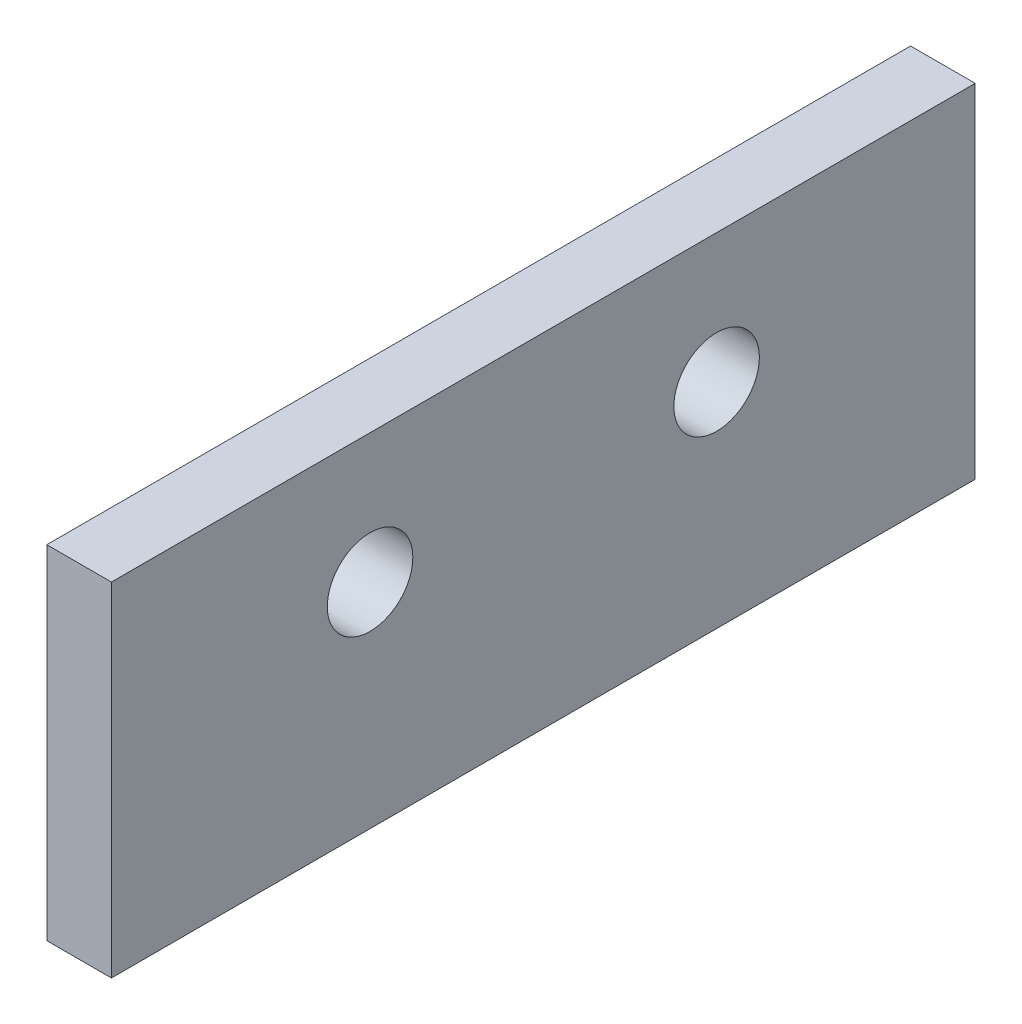
ISO-10303-21;
HEADER;
FILE_DESCRIPTION(('STEP AP214'),'2;1');
FILE_NAME('part.step','',(''),(''),'','','');
FILE_SCHEMA(('AUTOMOTIVE_DESIGN { 1 0 10303 214 1 1 1 1 }'));
ENDSEC;
DATA;
#1=APPLICATION_CONTEXT('core data for automotive mechanical design processes');
#2=APPLICATION_PROTOCOL_DEFINITION('international standard','automotive_design',2000,#1);
#3=PRODUCT_CONTEXT('',#1,'mechanical');
#4=PRODUCT('Part','Part','',(#3));
#5=PRODUCT_RELATED_PRODUCT_CATEGORY('part','',(#4));
#6=PRODUCT_DEFINITION_FORMATION('','',#4);
#7=PRODUCT_DEFINITION_CONTEXT('part definition',#1,'design');
#8=PRODUCT_DEFINITION('design','',#6,#7);
#9=PRODUCT_DEFINITION_SHAPE('','',#8);
#10=(LENGTH_UNIT() NAMED_UNIT(*) SI_UNIT(.MILLI.,.METRE.));
#11=(NAMED_UNIT(*) PLANE_ANGLE_UNIT() SI_UNIT($,.RADIAN.));
#12=(NAMED_UNIT(*) SI_UNIT($,.STERADIAN.) SOLID_ANGLE_UNIT());
#13=UNCERTAINTY_MEASURE_WITH_UNIT(LENGTH_MEASURE(1.E-05),#10,'distance_accuracy_value','');
#14=(GEOMETRIC_REPRESENTATION_CONTEXT(3) GLOBAL_UNCERTAINTY_ASSIGNED_CONTEXT((#13)) GLOBAL_UNIT_ASSIGNED_CONTEXT((#10,
#11,#12)) REPRESENTATION_CONTEXT('',''));
#15=CARTESIAN_POINT('',(0.,0.,0.));
#16=DIRECTION('',(0.,0.,1.));
#17=DIRECTION('',(1.,0.,0.));
#18=AXIS2_PLACEMENT_3D('',#15,#16,#17);
#19=CARTESIAN_POINT('',(3.175,-8.4201,-21.209));
#20=DIRECTION('',(0.,0.,1.));
#21=DIRECTION('',(1.,0.,0.));
#22=AXIS2_PLACEMENT_3D('',#19,#20,#21);
#23=PLANE('',#22);
#24=DIRECTION('',(0.,1.,0.));
#25=VECTOR('',#24,1.);
#26=CARTESIAN_POINT('',(0.,-8.4201,-21.209));
#27=LINE('',#26,#25);
#28=CARTESIAN_POINT('',(0.,-8.4201,-21.209));
#29=VERTEX_POINT('',#28);
#30=CARTESIAN_POINT('',(0.,8.4201,-21.209));
#31=VERTEX_POINT('',#30);
#32=EDGE_CURVE('E101',#29,#31,#27,.T.);
#33=ORIENTED_EDGE('',*,*,#32,.T.);
#34=DIRECTION('',(-1.,0.,0.));
#35=VECTOR('',#34,1.);
#36=CARTESIAN_POINT('',(3.175,8.4201,-21.209));
#37=LINE('',#36,#35);
#38=CARTESIAN_POINT('',(3.175,8.4201,-21.209));
#39=VERTEX_POINT('',#38);
#40=EDGE_CURVE('E11',#39,#31,#37,.T.);
#41=ORIENTED_EDGE('',*,*,#40,.F.);
#42=DIRECTION('',(0.,1.,0.));
#43=VECTOR('',#42,1.);
#44=CARTESIAN_POINT('',(3.175,-8.4201,-21.209));
#45=LINE('',#44,#43);
#46=CARTESIAN_POINT('',(3.175,-8.4201,-21.209));
#47=VERTEX_POINT('',#46);
#48=EDGE_CURVE('E89',#47,#39,#45,.T.);
#49=ORIENTED_EDGE('',*,*,#48,.F.);
#50=DIRECTION('',(-1.,0.,0.));
#51=VECTOR('',#50,1.);
#52=CARTESIAN_POINT('',(3.175,-8.4201,-21.209));
#53=LINE('',#52,#51);
#54=EDGE_CURVE('E97',#47,#29,#53,.T.);
#55=ORIENTED_EDGE('',*,*,#54,.T.);
#56=EDGE_LOOP('',(#33,#41,#49,#55));
#57=FACE_BOUND('',#56,.T.);
#58=ADVANCED_FACE('F38',(#57),#23,.F.);
#59=CARTESIAN_POINT('',(3.175,8.4201,21.209));
#60=DIRECTION('',(0.,-1.,0.));
#61=DIRECTION('',(0.,0.,-1.));
#62=AXIS2_PLACEMENT_3D('',#59,#60,#61);
#63=PLANE('',#62);
#64=DIRECTION('',(0.,0.,1.));
#65=VECTOR('',#64,1.);
#66=CARTESIAN_POINT('',(0.,8.4201,21.209));
#67=LINE('',#66,#65);
#68=CARTESIAN_POINT('',(0.,8.4201,21.209));
#69=VERTEX_POINT('',#68);
#70=EDGE_CURVE('E93',#31,#69,#67,.T.);
#71=ORIENTED_EDGE('',*,*,#70,.T.);
#72=DIRECTION('',(-1.,0.,0.));
#73=VECTOR('',#72,1.);
#74=CARTESIAN_POINT('',(3.175,8.4201,21.209));
#75=LINE('',#74,#73);
#76=CARTESIAN_POINT('',(3.175,8.4201,21.209));
#77=VERTEX_POINT('',#76);
#78=EDGE_CURVE('E46',#77,#69,#75,.T.);
#79=ORIENTED_EDGE('',*,*,#78,.F.);
#80=DIRECTION('',(0.,0.,1.));
#81=VECTOR('',#80,1.);
#82=CARTESIAN_POINT('',(3.175,8.4201,21.209));
#83=LINE('',#82,#81);
#84=EDGE_CURVE('E84',#39,#77,#83,.T.);
#85=ORIENTED_EDGE('',*,*,#84,.F.);
#86=ORIENTED_EDGE('',*,*,#40,.T.);
#87=EDGE_LOOP('',(#71,#79,#85,#86));
#88=FACE_BOUND('',#87,.T.);
#89=ADVANCED_FACE('F92',(#88),#63,.F.);
#90=CARTESIAN_POINT('',(3.175,-8.4201,21.209));
#91=DIRECTION('',(0.,0.,-1.));
#92=DIRECTION('',(-1.,0.,0.));
#93=AXIS2_PLACEMENT_3D('',#90,#91,#92);
#94=PLANE('',#93);
#95=DIRECTION('',(0.,-1.,0.));
#96=VECTOR('',#95,1.);
#97=CARTESIAN_POINT('',(0.,-8.4201,21.209));
#98=LINE('',#97,#96);
#99=CARTESIAN_POINT('',(0.,-8.4201,21.209));
#100=VERTEX_POINT('',#99);
#101=EDGE_CURVE('E71',#69,#100,#98,.T.);
#102=ORIENTED_EDGE('',*,*,#101,.T.);
#103=DIRECTION('',(-1.,0.,0.));
#104=VECTOR('',#103,1.);
#105=CARTESIAN_POINT('',(3.175,-8.4201,21.209));
#106=LINE('',#105,#104);
#107=CARTESIAN_POINT('',(3.175,-8.4201,21.209));
#108=VERTEX_POINT('',#107);
#109=EDGE_CURVE('E94',#108,#100,#106,.T.);
#110=ORIENTED_EDGE('',*,*,#109,.F.);
#111=DIRECTION('',(0.,-1.,0.));
#112=VECTOR('',#111,1.);
#113=CARTESIAN_POINT('',(3.175,-8.4201,21.209));
#114=LINE('',#113,#112);
#115=EDGE_CURVE('E87',#77,#108,#114,.T.);
#116=ORIENTED_EDGE('',*,*,#115,.F.);
#117=ORIENTED_EDGE('',*,*,#78,.T.);
#118=EDGE_LOOP('',(#102,#110,#116,#117));
#119=FACE_BOUND('',#118,.T.);
#120=ADVANCED_FACE('F95',(#119),#94,.F.);
#121=CARTESIAN_POINT('',(3.175,-8.4201,21.209));
#122=DIRECTION('',(0.,1.,0.));
#123=DIRECTION('',(0.,0.,1.));
#124=AXIS2_PLACEMENT_3D('',#121,#122,#123);
#125=PLANE('',#124);
#126=DIRECTION('',(0.,0.,-1.));
#127=VECTOR('',#126,1.);
#128=CARTESIAN_POINT('',(0.,-8.4201,21.209));
#129=LINE('',#128,#127);
#130=EDGE_CURVE('E77',#100,#29,#129,.T.);
#131=ORIENTED_EDGE('',*,*,#130,.T.);
#132=ORIENTED_EDGE('',*,*,#54,.F.);
#133=DIRECTION('',(0.,0.,-1.));
#134=VECTOR('',#133,1.);
#135=CARTESIAN_POINT('',(3.175,-8.4201,21.209));
#136=LINE('',#135,#134);
#137=EDGE_CURVE('E54',#108,#47,#136,.T.);
#138=ORIENTED_EDGE('',*,*,#137,.F.);
#139=ORIENTED_EDGE('',*,*,#109,.T.);
#140=EDGE_LOOP('',(#131,#132,#138,#139));
#141=FACE_BOUND('',#140,.T.);
#142=ADVANCED_FACE('F109',(#141),#125,.F.);
#143=CARTESIAN_POINT('',(3.175,0.,0.));
#144=DIRECTION('',(-1.,0.,0.));
#145=DIRECTION('',(0.,0.,1.));
#146=AXIS2_PLACEMENT_3D('',#143,#144,#145);
#147=PLANE('',#146);
#148=CARTESIAN_POINT('',(3.175,2.0701,8.509));
#149=DIRECTION('',(1.,0.,0.));
#150=DIRECTION('',(0.,0.,-1.));
#151=AXIS2_PLACEMENT_3D('',#148,#149,#150);
#152=CIRCLE('',#151,2.1);
#153=CARTESIAN_POINT('',(3.175,2.0701,6.409));
#154=VERTEX_POINT('',#153);
#155=EDGE_CURVE('E121',#154,#154,#152,.T.);
#156=ORIENTED_EDGE('',*,*,#155,.F.);
#157=EDGE_LOOP('',(#156));
#158=FACE_BOUND('',#157,.T.);
#159=CARTESIAN_POINT('',(3.175,2.0701,-8.509));
#160=DIRECTION('',(1.,0.,0.));
#161=DIRECTION('',(0.,0.,-1.));
#162=AXIS2_PLACEMENT_3D('',#159,#160,#161);
#163=CIRCLE('',#162,2.1);
#164=CARTESIAN_POINT('',(3.175,2.0701,-10.609));
#165=VERTEX_POINT('',#164);
#166=EDGE_CURVE('E118',#165,#165,#163,.T.);
#167=ORIENTED_EDGE('',*,*,#166,.F.);
#168=EDGE_LOOP('',(#167));
#169=FACE_BOUND('',#168,.T.);
#170=ORIENTED_EDGE('',*,*,#48,.T.);
#171=ORIENTED_EDGE('',*,*,#84,.T.);
#172=ORIENTED_EDGE('',*,*,#115,.T.);
#173=ORIENTED_EDGE('',*,*,#137,.T.);
#174=EDGE_LOOP('',(#170,#171,#172,#173));
#175=FACE_BOUND('',#174,.T.);
#176=ADVANCED_FACE('F85',(#158,#169,#175),#147,.F.);
#177=CARTESIAN_POINT('',(0.,0.,0.));
#178=DIRECTION('',(-1.,0.,0.));
#179=DIRECTION('',(0.,0.,1.));
#180=AXIS2_PLACEMENT_3D('',#177,#178,#179);
#181=PLANE('',#180);
#182=CARTESIAN_POINT('',(0.,2.0701,8.509));
#183=DIRECTION('',(1.,0.,0.));
#184=DIRECTION('',(0.,0.,-1.));
#185=AXIS2_PLACEMENT_3D('',#182,#183,#184);
#186=CIRCLE('',#185,2.1);
#187=CARTESIAN_POINT('',(0.,2.0701,6.409));
#188=VERTEX_POINT('',#187);
#189=EDGE_CURVE('E104',#188,#188,#186,.T.);
#190=ORIENTED_EDGE('',*,*,#189,.T.);
#191=EDGE_LOOP('',(#190));
#192=FACE_BOUND('',#191,.T.);
#193=CARTESIAN_POINT('',(0.,2.0701,-8.509));
#194=DIRECTION('',(1.,0.,0.));
#195=DIRECTION('',(0.,0.,-1.));
#196=AXIS2_PLACEMENT_3D('',#193,#194,#195);
#197=CIRCLE('',#196,2.1);
#198=CARTESIAN_POINT('',(0.,2.0701,-10.609));
#199=VERTEX_POINT('',#198);
#200=EDGE_CURVE('E115',#199,#199,#197,.T.);
#201=ORIENTED_EDGE('',*,*,#200,.T.);
#202=EDGE_LOOP('',(#201));
#203=FACE_BOUND('',#202,.T.);
#204=ORIENTED_EDGE('',*,*,#32,.F.);
#205=ORIENTED_EDGE('',*,*,#130,.F.);
#206=ORIENTED_EDGE('',*,*,#101,.F.);
#207=ORIENTED_EDGE('',*,*,#70,.F.);
#208=EDGE_LOOP('',(#204,#205,#206,#207));
#209=FACE_BOUND('',#208,.T.);
#210=ADVANCED_FACE('F112',(#192,#203,#209),#181,.T.);
#211=CARTESIAN_POINT('',(0.,2.0701,-8.509));
#212=DIRECTION('',(1.,0.,0.));
#213=DIRECTION('',(0.,0.,-1.));
#214=AXIS2_PLACEMENT_3D('',#211,#212,#213);
#215=CYLINDRICAL_SURFACE('',#214,2.1);
#216=ORIENTED_EDGE('',*,*,#200,.F.);
#217=EDGE_LOOP('',(#216));
#218=FACE_BOUND('',#217,.T.);
#219=ORIENTED_EDGE('',*,*,#166,.T.);
#220=EDGE_LOOP('',(#219));
#221=FACE_BOUND('',#220,.T.);
#222=ADVANCED_FACE('F132',(#218,#221),#215,.F.);
#223=CARTESIAN_POINT('',(0.,2.0701,8.509));
#224=DIRECTION('',(1.,0.,0.));
#225=DIRECTION('',(0.,0.,-1.));
#226=AXIS2_PLACEMENT_3D('',#223,#224,#225);
#227=CYLINDRICAL_SURFACE('',#226,2.1);
#228=ORIENTED_EDGE('',*,*,#189,.F.);
#229=EDGE_LOOP('',(#228));
#230=FACE_BOUND('',#229,.T.);
#231=ORIENTED_EDGE('',*,*,#155,.T.);
#232=EDGE_LOOP('',(#231));
#233=FACE_BOUND('',#232,.T.);
#234=ADVANCED_FACE('F129',(#230,#233),#227,.F.);
#235=CLOSED_SHELL('',(#58,#89,#120,#142,#176,#210,#222,#234));
#236=MANIFOLD_SOLID_BREP('B2',#235);
#237=ADVANCED_BREP_SHAPE_REPRESENTATION('',(#18,#236),#14);
#238=SHAPE_DEFINITION_REPRESENTATION(#9,#237);
ENDSEC;
END-ISO-10303-21;
